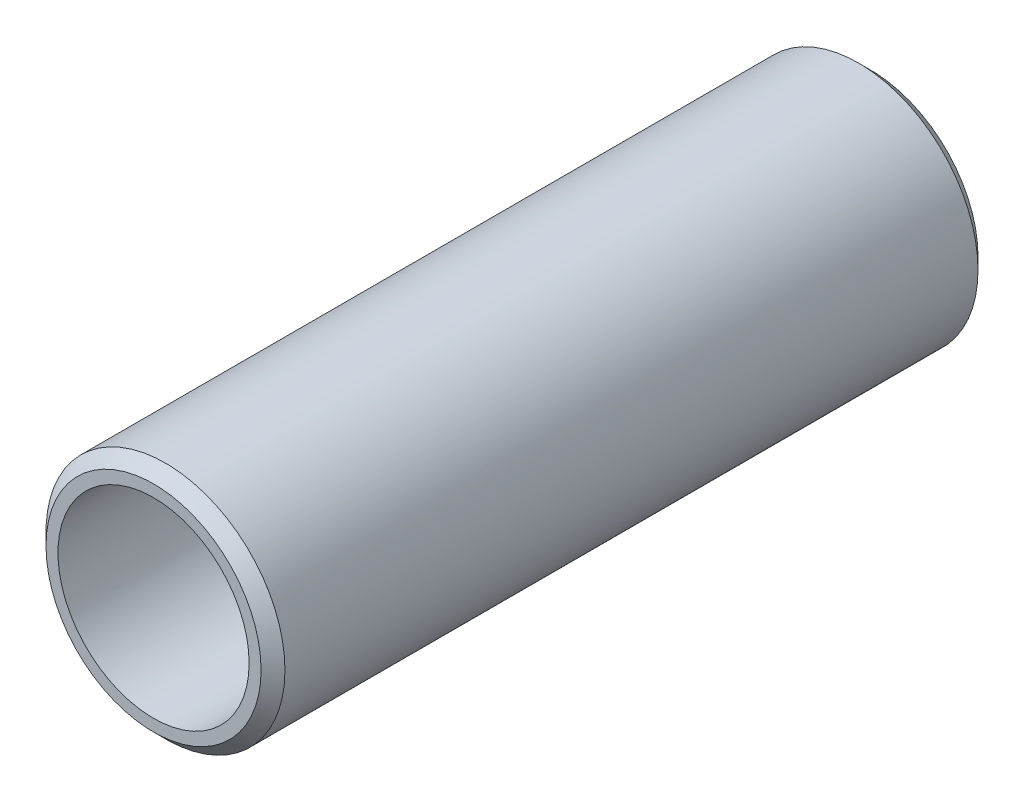
ISO-10303-21;
HEADER;
FILE_DESCRIPTION(('STEP AP214'),'2;1');
FILE_NAME('part.step','',(''),(''),'','','');
FILE_SCHEMA(('AUTOMOTIVE_DESIGN { 1 0 10303 214 1 1 1 1 }'));
ENDSEC;
DATA;
#1=APPLICATION_CONTEXT('core data for automotive mechanical design processes');
#2=APPLICATION_PROTOCOL_DEFINITION('international standard','automotive_design',2000,#1);
#3=PRODUCT_CONTEXT('',#1,'mechanical');
#4=PRODUCT('Part','Part','',(#3));
#5=PRODUCT_RELATED_PRODUCT_CATEGORY('part','',(#4));
#6=PRODUCT_DEFINITION_FORMATION('','',#4);
#7=PRODUCT_DEFINITION_CONTEXT('part definition',#1,'design');
#8=PRODUCT_DEFINITION('design','',#6,#7);
#9=PRODUCT_DEFINITION_SHAPE('','',#8);
#10=(LENGTH_UNIT() NAMED_UNIT(*) SI_UNIT(.MILLI.,.METRE.));
#11=(NAMED_UNIT(*) PLANE_ANGLE_UNIT() SI_UNIT($,.RADIAN.));
#12=(NAMED_UNIT(*) SI_UNIT($,.STERADIAN.) SOLID_ANGLE_UNIT());
#13=UNCERTAINTY_MEASURE_WITH_UNIT(LENGTH_MEASURE(1.E-05),#10,'distance_accuracy_value','');
#14=(GEOMETRIC_REPRESENTATION_CONTEXT(3) GLOBAL_UNCERTAINTY_ASSIGNED_CONTEXT((#13)) GLOBAL_UNIT_ASSIGNED_CONTEXT((#10,
#11,#12)) REPRESENTATION_CONTEXT('',''));
#15=CARTESIAN_POINT('',(0.,0.,0.));
#16=DIRECTION('',(0.,0.,1.));
#17=DIRECTION('',(1.,0.,0.));
#18=AXIS2_PLACEMENT_3D('',#15,#16,#17);
#19=CARTESIAN_POINT('',(0.,0.,30.));
#20=DIRECTION('',(0.,0.,1.));
#21=DIRECTION('',(1.,0.,0.));
#22=AXIS2_PLACEMENT_3D('',#19,#20,#21);
#23=PLANE('',#22);
#24=CARTESIAN_POINT('',(0.,0.,30.));
#25=DIRECTION('',(0.,0.,1.));
#26=DIRECTION('',(1.,0.,0.));
#27=AXIS2_PLACEMENT_3D('',#24,#25,#26);
#28=CIRCLE('',#27,4.5);
#29=CARTESIAN_POINT('',(4.5,0.,30.));
#30=VERTEX_POINT('',#29);
#31=EDGE_CURVE('E11',#30,#30,#28,.T.);
#32=ORIENTED_EDGE('',*,*,#31,.T.);
#33=EDGE_LOOP('',(#32));
#34=FACE_BOUND('',#33,.T.);
#35=CARTESIAN_POINT('',(0.,0.,30.));
#36=DIRECTION('',(0.,0.,1.));
#37=DIRECTION('',(1.,0.,0.));
#38=AXIS2_PLACEMENT_3D('',#35,#36,#37);
#39=CIRCLE('',#38,4.);
#40=CARTESIAN_POINT('',(4.,0.,30.));
#41=VERTEX_POINT('',#40);
#42=EDGE_CURVE('E57',#41,#41,#39,.T.);
#43=ORIENTED_EDGE('',*,*,#42,.F.);
#44=EDGE_LOOP('',(#43));
#45=FACE_BOUND('',#44,.T.);
#46=ADVANCED_FACE('F37',(#34,#45),#23,.T.);
#47=CARTESIAN_POINT('',(0.,0.,0.));
#48=DIRECTION('',(0.,0.,1.));
#49=DIRECTION('',(1.,0.,0.));
#50=AXIS2_PLACEMENT_3D('',#47,#48,#49);
#51=PLANE('',#50);
#52=CARTESIAN_POINT('',(0.,0.,0.));
#53=DIRECTION('',(0.,0.,1.));
#54=DIRECTION('',(1.,0.,0.));
#55=AXIS2_PLACEMENT_3D('',#52,#53,#54);
#56=CIRCLE('',#55,4.49999999999999);
#57=CARTESIAN_POINT('',(4.49999999999999,0.,0.));
#58=VERTEX_POINT('',#57);
#59=EDGE_CURVE('E44',#58,#58,#56,.F.);
#60=ORIENTED_EDGE('',*,*,#59,.T.);
#61=EDGE_LOOP('',(#60));
#62=FACE_BOUND('',#61,.T.);
#63=CARTESIAN_POINT('',(0.,0.,0.));
#64=DIRECTION('',(0.,0.,1.));
#65=DIRECTION('',(1.,0.,0.));
#66=AXIS2_PLACEMENT_3D('',#63,#64,#65);
#67=CIRCLE('',#66,4.);
#68=CARTESIAN_POINT('',(4.,0.,0.));
#69=VERTEX_POINT('',#68);
#70=EDGE_CURVE('E58',#69,#69,#67,.T.);
#71=ORIENTED_EDGE('',*,*,#70,.T.);
#72=EDGE_LOOP('',(#71));
#73=FACE_BOUND('',#72,.T.);
#74=ADVANCED_FACE('F68',(#62,#73),#51,.F.);
#75=CARTESIAN_POINT('',(0.,0.,30.));
#76=DIRECTION('',(0.,0.,-1.));
#77=DIRECTION('',(-1.,0.,0.));
#78=AXIS2_PLACEMENT_3D('',#75,#76,#77);
#79=CYLINDRICAL_SURFACE('',#78,5.);
#80=CARTESIAN_POINT('',(0.,0.,0.500000000000004));
#81=DIRECTION('',(0.,0.,1.));
#82=DIRECTION('',(1.,0.,0.));
#83=AXIS2_PLACEMENT_3D('',#80,#81,#82);
#84=CIRCLE('',#83,5.);
#85=CARTESIAN_POINT('',(5.,0.,0.500000000000004));
#86=VERTEX_POINT('',#85);
#87=EDGE_CURVE('E48',#86,#86,#84,.T.);
#88=ORIENTED_EDGE('',*,*,#87,.T.);
#89=EDGE_LOOP('',(#88));
#90=FACE_BOUND('',#89,.T.);
#91=CARTESIAN_POINT('',(0.,0.,29.5));
#92=DIRECTION('',(0.,0.,1.));
#93=DIRECTION('',(1.,0.,0.));
#94=AXIS2_PLACEMENT_3D('',#91,#92,#93);
#95=CIRCLE('',#94,5.);
#96=CARTESIAN_POINT('',(5.,0.,29.5));
#97=VERTEX_POINT('',#96);
#98=EDGE_CURVE('E52',#97,#97,#95,.F.);
#99=ORIENTED_EDGE('',*,*,#98,.T.);
#100=EDGE_LOOP('',(#99));
#101=FACE_BOUND('',#100,.T.);
#102=ADVANCED_FACE('F73',(#90,#101),#79,.T.);
#103=CARTESIAN_POINT('',(0.,0.,30.));
#104=DIRECTION('',(0.,0.,-1.));
#105=DIRECTION('',(-1.,0.,0.));
#106=AXIS2_PLACEMENT_3D('',#103,#104,#105);
#107=CYLINDRICAL_SURFACE('',#106,4.);
#108=ORIENTED_EDGE('',*,*,#42,.T.);
#109=EDGE_LOOP('',(#108));
#110=FACE_BOUND('',#109,.T.);
#111=ORIENTED_EDGE('',*,*,#70,.F.);
#112=EDGE_LOOP('',(#111));
#113=FACE_BOUND('',#112,.T.);
#114=ADVANCED_FACE('F64',(#110,#113),#107,.F.);
#115=CARTESIAN_POINT('',(0.,0.,0.500000000000004));
#116=DIRECTION('',(0.,0.,1.));
#117=DIRECTION('',(1.,0.,0.));
#118=AXIS2_PLACEMENT_3D('',#115,#116,#117);
#119=CONICAL_SURFACE('',#118,5.,0.785398163397451);
#120=ORIENTED_EDGE('',*,*,#59,.F.);
#121=EDGE_LOOP('',(#120));
#122=FACE_BOUND('',#121,.T.);
#123=ORIENTED_EDGE('',*,*,#87,.F.);
#124=EDGE_LOOP('',(#123));
#125=FACE_BOUND('',#124,.T.);
#126=ADVANCED_FACE('F79',(#122,#125),#119,.T.);
#127=CARTESIAN_POINT('',(0.,0.,30.));
#128=DIRECTION('',(0.,0.,-1.));
#129=DIRECTION('',(-1.,0.,0.));
#130=AXIS2_PLACEMENT_3D('',#127,#128,#129);
#131=CONICAL_SURFACE('',#130,4.5,0.785398163397451);
#132=ORIENTED_EDGE('',*,*,#98,.F.);
#133=EDGE_LOOP('',(#132));
#134=FACE_BOUND('',#133,.T.);
#135=ORIENTED_EDGE('',*,*,#31,.F.);
#136=EDGE_LOOP('',(#135));
#137=FACE_BOUND('',#136,.T.);
#138=ADVANCED_FACE('F39',(#134,#137),#131,.T.);
#139=CLOSED_SHELL('',(#46,#74,#102,#114,#126,#138));
#140=MANIFOLD_SOLID_BREP('B2',#139);
#141=ADVANCED_BREP_SHAPE_REPRESENTATION('',(#18,#140),#14);
#142=SHAPE_DEFINITION_REPRESENTATION(#9,#141);
ENDSEC;
END-ISO-10303-21;
